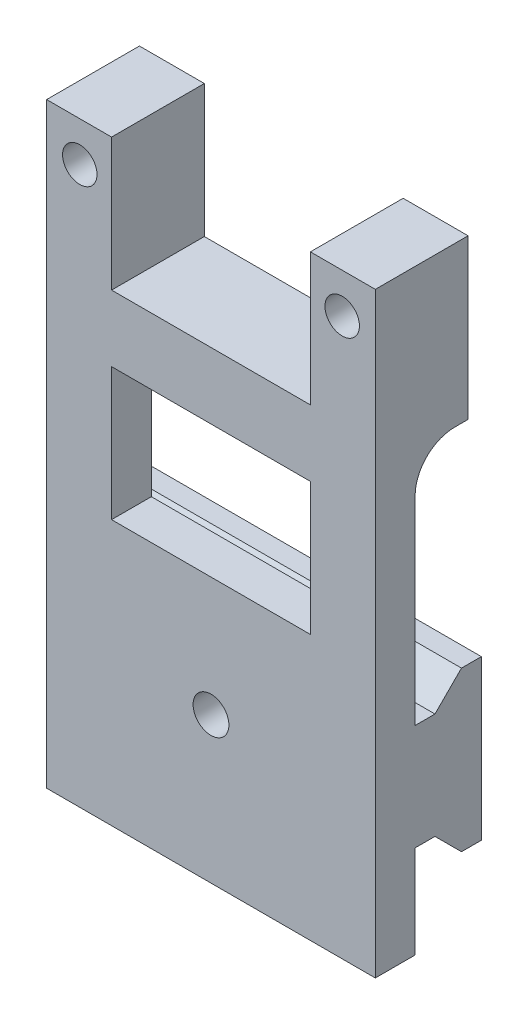
ISO-10303-21;
HEADER;
FILE_DESCRIPTION(('STEP AP214'),'2;1');
FILE_NAME('part.step','',(''),(''),'','','');
FILE_SCHEMA(('AUTOMOTIVE_DESIGN { 1 0 10303 214 1 1 1 1 }'));
ENDSEC;
DATA;
#1=APPLICATION_CONTEXT('core data for automotive mechanical design processes');
#2=APPLICATION_PROTOCOL_DEFINITION('international standard','automotive_design',2000,#1);
#3=PRODUCT_CONTEXT('',#1,'mechanical');
#4=PRODUCT('Part','Part','',(#3));
#5=PRODUCT_RELATED_PRODUCT_CATEGORY('part','',(#4));
#6=PRODUCT_DEFINITION_FORMATION('','',#4);
#7=PRODUCT_DEFINITION_CONTEXT('part definition',#1,'design');
#8=PRODUCT_DEFINITION('design','',#6,#7);
#9=PRODUCT_DEFINITION_SHAPE('','',#8);
#10=(LENGTH_UNIT() NAMED_UNIT(*) SI_UNIT(.MILLI.,.METRE.));
#11=(NAMED_UNIT(*) PLANE_ANGLE_UNIT() SI_UNIT($,.RADIAN.));
#12=(NAMED_UNIT(*) SI_UNIT($,.STERADIAN.) SOLID_ANGLE_UNIT());
#13=UNCERTAINTY_MEASURE_WITH_UNIT(LENGTH_MEASURE(1.E-05),#10,'distance_accuracy_value','');
#14=(GEOMETRIC_REPRESENTATION_CONTEXT(3) GLOBAL_UNCERTAINTY_ASSIGNED_CONTEXT((#13)) GLOBAL_UNIT_ASSIGNED_CONTEXT((#10,
#11,#12)) REPRESENTATION_CONTEXT('',''));
#15=CARTESIAN_POINT('',(0.,0.,0.));
#16=DIRECTION('',(0.,0.,1.));
#17=DIRECTION('',(1.,0.,0.));
#18=AXIS2_PLACEMENT_3D('',#15,#16,#17);
#19=CARTESIAN_POINT('',(12.4,-35.,4.));
#20=DIRECTION('',(0.,0.,1.));
#21=DIRECTION('',(1.,0.,0.));
#22=AXIS2_PLACEMENT_3D('',#19,#20,#21);
#23=PLANE('',#22);
#24=DIRECTION('',(1.,0.,0.));
#25=VECTOR('',#24,1.);
#26=CARTESIAN_POINT('',(-12.4,-28.,4.));
#27=LINE('',#26,#25);
#28=CARTESIAN_POINT('',(-12.4,-28.,4.));
#29=VERTEX_POINT('',#28);
#30=CARTESIAN_POINT('',(12.4,-28.,4.));
#31=VERTEX_POINT('',#30);
#32=EDGE_CURVE('E259',#29,#31,#27,.T.);
#33=ORIENTED_EDGE('',*,*,#32,.T.);
#34=DIRECTION('',(0.,1.,0.));
#35=VECTOR('',#34,1.);
#36=CARTESIAN_POINT('',(12.4,-35.,4.));
#37=LINE('',#36,#35);
#38=CARTESIAN_POINT('',(12.4,-35.,4.));
#39=VERTEX_POINT('',#38);
#40=EDGE_CURVE('E278',#39,#31,#37,.T.);
#41=ORIENTED_EDGE('',*,*,#40,.F.);
#42=DIRECTION('',(-1.,0.,0.));
#43=VECTOR('',#42,1.);
#44=CARTESIAN_POINT('',(12.4,-35.,4.));
#45=LINE('',#44,#43);
#46=CARTESIAN_POINT('',(-12.4,-35.,4.));
#47=VERTEX_POINT('',#46);
#48=EDGE_CURVE('E284',#39,#47,#45,.T.);
#49=ORIENTED_EDGE('',*,*,#48,.T.);
#50=DIRECTION('',(0.,1.,0.));
#51=VECTOR('',#50,1.);
#52=CARTESIAN_POINT('',(-12.4,-35.,4.));
#53=LINE('',#52,#51);
#54=EDGE_CURVE('E285',#47,#29,#53,.T.);
#55=ORIENTED_EDGE('',*,*,#54,.T.);
#56=EDGE_LOOP('',(#33,#41,#49,#55));
#57=FACE_BOUND('',#56,.T.);
#58=ADVANCED_FACE('F33',(#57),#23,.F.);
#59=DIRECTION('',(-1.,0.,0.));
#60=VECTOR('',#59,1.);
#61=CARTESIAN_POINT('',(12.4,-5.,4.));
#62=LINE('',#61,#60);
#63=CARTESIAN_POINT('',(-12.4,-5.,4.));
#64=VERTEX_POINT('',#63);
#65=CARTESIAN_POINT('',(-7.5,-5.,4.));
#66=VERTEX_POINT('',#65);
#67=EDGE_CURVE('E367',#64,#66,#62,.F.);
#68=ORIENTED_EDGE('',*,*,#67,.T.);
#69=DIRECTION('',(0.,-1.,0.));
#70=VECTOR('',#69,1.);
#71=CARTESIAN_POINT('',(-7.5,-35.,4.));
#72=LINE('',#71,#70);
#73=CARTESIAN_POINT('',(-7.5,-15.,4.));
#74=VERTEX_POINT('',#73);
#75=EDGE_CURVE('E218',#66,#74,#72,.T.);
#76=ORIENTED_EDGE('',*,*,#75,.T.);
#77=DIRECTION('',(1.,0.,0.));
#78=VECTOR('',#77,1.);
#79=CARTESIAN_POINT('',(12.4,-15.,4.));
#80=LINE('',#79,#78);
#81=CARTESIAN_POINT('',(7.5,-15.,4.));
#82=VERTEX_POINT('',#81);
#83=EDGE_CURVE('E221',#74,#82,#80,.T.);
#84=ORIENTED_EDGE('',*,*,#83,.T.);
#85=DIRECTION('',(0.,1.,0.));
#86=VECTOR('',#85,1.);
#87=CARTESIAN_POINT('',(7.5,-35.,4.));
#88=LINE('',#87,#86);
#89=CARTESIAN_POINT('',(7.5,-5.,4.));
#90=VERTEX_POINT('',#89);
#91=EDGE_CURVE('E196',#82,#90,#88,.T.);
#92=ORIENTED_EDGE('',*,*,#91,.T.);
#93=CARTESIAN_POINT('',(12.4,-5.,4.));
#94=VERTEX_POINT('',#93);
#95=EDGE_CURVE('E366',#90,#94,#62,.F.);
#96=ORIENTED_EDGE('',*,*,#95,.T.);
#97=CARTESIAN_POINT('',(12.4,-20.,4.));
#98=VERTEX_POINT('',#97);
#99=EDGE_CURVE('E282',#98,#94,#37,.T.);
#100=ORIENTED_EDGE('',*,*,#99,.F.);
#101=DIRECTION('',(1.,0.,0.));
#102=VECTOR('',#101,1.);
#103=CARTESIAN_POINT('',(-12.4,-20.,4.));
#104=LINE('',#103,#102);
#105=CARTESIAN_POINT('',(-12.4,-20.,4.));
#106=VERTEX_POINT('',#105);
#107=EDGE_CURVE('E256',#106,#98,#104,.T.);
#108=ORIENTED_EDGE('',*,*,#107,.F.);
#109=EDGE_CURVE('E277',#106,#64,#53,.T.);
#110=ORIENTED_EDGE('',*,*,#109,.T.);
#111=EDGE_LOOP('',(#68,#76,#84,#92,#96,#100,#108,#110));
#112=FACE_BOUND('',#111,.T.);
#113=ADVANCED_FACE('F380',(#112),#23,.F.);
#114=CARTESIAN_POINT('',(0.,0.,7.));
#115=DIRECTION('',(0.,0.,-1.));
#116=DIRECTION('',(-1.,0.,0.));
#117=AXIS2_PLACEMENT_3D('',#114,#115,#116);
#118=PLANE('',#117);
#119=CARTESIAN_POINT('',(0.,-24.,7.));
#120=DIRECTION('',(0.,0.,1.));
#121=DIRECTION('',(1.,0.,0.));
#122=AXIS2_PLACEMENT_3D('',#119,#120,#121);
#123=CIRCLE('',#122,1.35);
#124=CARTESIAN_POINT('',(1.35,-24.,7.));
#125=VERTEX_POINT('',#124);
#126=EDGE_CURVE('E650',#125,#125,#123,.T.);
#127=ORIENTED_EDGE('',*,*,#126,.F.);
#128=EDGE_LOOP('',(#127));
#129=FACE_BOUND('',#128,.T.);
#130=DIRECTION('',(1.,0.,0.));
#131=VECTOR('',#130,1.);
#132=CARTESIAN_POINT('',(-7.5,-15.,7.));
#133=LINE('',#132,#131);
#134=CARTESIAN_POINT('',(-7.5,-15.,7.));
#135=VERTEX_POINT('',#134);
#136=CARTESIAN_POINT('',(7.5,-15.,7.));
#137=VERTEX_POINT('',#136);
#138=EDGE_CURVE('E203',#135,#137,#133,.T.);
#139=ORIENTED_EDGE('',*,*,#138,.F.);
#140=DIRECTION('',(0.,-1.,0.));
#141=VECTOR('',#140,1.);
#142=CARTESIAN_POINT('',(-7.5,-5.,7.));
#143=LINE('',#142,#141);
#144=CARTESIAN_POINT('',(-7.5,-5.,7.));
#145=VERTEX_POINT('',#144);
#146=EDGE_CURVE('E48',#145,#135,#143,.T.);
#147=ORIENTED_EDGE('',*,*,#146,.F.);
#148=DIRECTION('',(-1.,0.,0.));
#149=VECTOR('',#148,1.);
#150=CARTESIAN_POINT('',(-7.5,-5.,7.));
#151=LINE('',#150,#149);
#152=CARTESIAN_POINT('',(7.5,-5.,7.));
#153=VERTEX_POINT('',#152);
#154=EDGE_CURVE('E209',#153,#145,#151,.T.);
#155=ORIENTED_EDGE('',*,*,#154,.F.);
#156=DIRECTION('',(0.,1.,0.));
#157=VECTOR('',#156,1.);
#158=CARTESIAN_POINT('',(7.5,-5.,7.));
#159=LINE('',#158,#157);
#160=EDGE_CURVE('E193',#137,#153,#159,.T.);
#161=ORIENTED_EDGE('',*,*,#160,.F.);
#162=EDGE_LOOP('',(#139,#147,#155,#161));
#163=FACE_BOUND('',#162,.T.);
#164=DIRECTION('',(-1.,0.,0.));
#165=VECTOR('',#164,1.);
#166=CARTESIAN_POINT('',(-12.4,10.,7.));
#167=LINE('',#166,#165);
#168=CARTESIAN_POINT('',(-7.5,10.,7.));
#169=VERTEX_POINT('',#168);
#170=CARTESIAN_POINT('',(-12.4,10.,7.));
#171=VERTEX_POINT('',#170);
#172=EDGE_CURVE('E307',#169,#171,#167,.T.);
#173=ORIENTED_EDGE('',*,*,#172,.T.);
#174=DIRECTION('',(0.,-1.,0.));
#175=VECTOR('',#174,1.);
#176=CARTESIAN_POINT('',(-12.4,-35.,7.));
#177=LINE('',#176,#175);
#178=CARTESIAN_POINT('',(-12.4,-35.,7.));
#179=VERTEX_POINT('',#178);
#180=EDGE_CURVE('E310',#171,#179,#177,.T.);
#181=ORIENTED_EDGE('',*,*,#180,.T.);
#182=DIRECTION('',(1.,0.,0.));
#183=VECTOR('',#182,1.);
#184=CARTESIAN_POINT('',(12.4,-35.,7.));
#185=LINE('',#184,#183);
#186=CARTESIAN_POINT('',(12.4,-35.,7.));
#187=VERTEX_POINT('',#186);
#188=EDGE_CURVE('E313',#179,#187,#185,.T.);
#189=ORIENTED_EDGE('',*,*,#188,.T.);
#190=DIRECTION('',(0.,1.,0.));
#191=VECTOR('',#190,1.);
#192=CARTESIAN_POINT('',(12.4,10.,7.));
#193=LINE('',#192,#191);
#194=CARTESIAN_POINT('',(12.4,10.,7.));
#195=VERTEX_POINT('',#194);
#196=EDGE_CURVE('E315',#187,#195,#193,.T.);
#197=ORIENTED_EDGE('',*,*,#196,.T.);
#198=DIRECTION('',(-1.,0.,0.));
#199=VECTOR('',#198,1.);
#200=CARTESIAN_POINT('',(7.5,10.,7.));
#201=LINE('',#200,#199);
#202=CARTESIAN_POINT('',(7.5,10.,7.));
#203=VERTEX_POINT('',#202);
#204=EDGE_CURVE('E317',#195,#203,#201,.T.);
#205=ORIENTED_EDGE('',*,*,#204,.T.);
#206=DIRECTION('',(0.,-1.,0.));
#207=VECTOR('',#206,1.);
#208=CARTESIAN_POINT('',(7.5,0.,7.));
#209=LINE('',#208,#207);
#210=CARTESIAN_POINT('',(7.5,0.,7.));
#211=VERTEX_POINT('',#210);
#212=EDGE_CURVE('E319',#203,#211,#209,.T.);
#213=ORIENTED_EDGE('',*,*,#212,.T.);
#214=DIRECTION('',(-1.,0.,0.));
#215=VECTOR('',#214,1.);
#216=CARTESIAN_POINT('',(-7.5,0.,7.));
#217=LINE('',#216,#215);
#218=CARTESIAN_POINT('',(-7.5,0.,7.));
#219=VERTEX_POINT('',#218);
#220=EDGE_CURVE('E321',#211,#219,#217,.T.);
#221=ORIENTED_EDGE('',*,*,#220,.T.);
#222=DIRECTION('',(0.,1.,0.));
#223=VECTOR('',#222,1.);
#224=CARTESIAN_POINT('',(-7.5,10.,7.));
#225=LINE('',#224,#223);
#226=EDGE_CURVE('E323',#219,#169,#225,.T.);
#227=ORIENTED_EDGE('',*,*,#226,.T.);
#228=EDGE_LOOP('',(#173,#181,#189,#197,#205,#213,#221,#227));
#229=FACE_BOUND('',#228,.T.);
#230=CARTESIAN_POINT('',(-9.9,7.,7.));
#231=DIRECTION('',(0.,0.,1.));
#232=DIRECTION('',(1.,0.,0.));
#233=AXIS2_PLACEMENT_3D('',#230,#231,#232);
#234=CIRCLE('',#233,1.3);
#235=CARTESIAN_POINT('',(-8.6,7.,7.));
#236=VERTEX_POINT('',#235);
#237=EDGE_CURVE('E301',#236,#236,#234,.T.);
#238=ORIENTED_EDGE('',*,*,#237,.F.);
#239=EDGE_LOOP('',(#238));
#240=FACE_BOUND('',#239,.T.);
#241=CARTESIAN_POINT('',(9.9,7.,7.));
#242=DIRECTION('',(0.,0.,1.));
#243=DIRECTION('',(1.,0.,0.));
#244=AXIS2_PLACEMENT_3D('',#241,#242,#243);
#245=CIRCLE('',#244,1.3);
#246=CARTESIAN_POINT('',(11.2,7.,7.));
#247=VERTEX_POINT('',#246);
#248=EDGE_CURVE('E295',#247,#247,#245,.T.);
#249=ORIENTED_EDGE('',*,*,#248,.F.);
#250=EDGE_LOOP('',(#249));
#251=FACE_BOUND('',#250,.T.);
#252=ADVANCED_FACE('F207',(#129,#163,#229,#240,#251),#118,.F.);
#253=CARTESIAN_POINT('',(0.,0.,0.));
#254=DIRECTION('',(0.,0.,-1.));
#255=DIRECTION('',(-1.,0.,0.));
#256=AXIS2_PLACEMENT_3D('',#253,#254,#255);
#257=PLANE('',#256);
#258=DIRECTION('',(-1.,0.,0.));
#259=VECTOR('',#258,1.);
#260=CARTESIAN_POINT('',(12.4,-2.,0.));
#261=LINE('',#260,#259);
#262=CARTESIAN_POINT('',(12.4,-2.,0.));
#263=VERTEX_POINT('',#262);
#264=CARTESIAN_POINT('',(-12.4,-2.,0.));
#265=VERTEX_POINT('',#264);
#266=EDGE_CURVE('E290',#263,#265,#261,.T.);
#267=ORIENTED_EDGE('',*,*,#266,.T.);
#268=DIRECTION('',(0.,-1.,0.));
#269=VECTOR('',#268,1.);
#270=CARTESIAN_POINT('',(-12.4,-35.,0.));
#271=LINE('',#270,#269);
#272=CARTESIAN_POINT('',(-12.4,10.,0.));
#273=VERTEX_POINT('',#272);
#274=EDGE_CURVE('E328',#273,#265,#271,.T.);
#275=ORIENTED_EDGE('',*,*,#274,.F.);
#276=DIRECTION('',(-1.,0.,0.));
#277=VECTOR('',#276,1.);
#278=CARTESIAN_POINT('',(-12.4,10.,0.));
#279=LINE('',#278,#277);
#280=CARTESIAN_POINT('',(-7.5,10.,0.));
#281=VERTEX_POINT('',#280);
#282=EDGE_CURVE('E304',#281,#273,#279,.T.);
#283=ORIENTED_EDGE('',*,*,#282,.F.);
#284=DIRECTION('',(0.,1.,0.));
#285=VECTOR('',#284,1.);
#286=CARTESIAN_POINT('',(-7.5,10.,0.));
#287=LINE('',#286,#285);
#288=CARTESIAN_POINT('',(-7.5,0.,0.));
#289=VERTEX_POINT('',#288);
#290=EDGE_CURVE('E311',#289,#281,#287,.T.);
#291=ORIENTED_EDGE('',*,*,#290,.F.);
#292=DIRECTION('',(-1.,0.,0.));
#293=VECTOR('',#292,1.);
#294=CARTESIAN_POINT('',(-7.5,0.,0.));
#295=LINE('',#294,#293);
#296=CARTESIAN_POINT('',(7.5,0.,0.));
#297=VERTEX_POINT('',#296);
#298=EDGE_CURVE('E337',#297,#289,#295,.T.);
#299=ORIENTED_EDGE('',*,*,#298,.F.);
#300=DIRECTION('',(0.,-1.,0.));
#301=VECTOR('',#300,1.);
#302=CARTESIAN_POINT('',(7.5,0.,0.));
#303=LINE('',#302,#301);
#304=CARTESIAN_POINT('',(7.5,10.,0.));
#305=VERTEX_POINT('',#304);
#306=EDGE_CURVE('E335',#305,#297,#303,.T.);
#307=ORIENTED_EDGE('',*,*,#306,.F.);
#308=DIRECTION('',(-1.,0.,0.));
#309=VECTOR('',#308,1.);
#310=CARTESIAN_POINT('',(7.5,10.,0.));
#311=LINE('',#310,#309);
#312=CARTESIAN_POINT('',(12.4,10.,0.));
#313=VERTEX_POINT('',#312);
#314=EDGE_CURVE('E333',#313,#305,#311,.T.);
#315=ORIENTED_EDGE('',*,*,#314,.F.);
#316=DIRECTION('',(0.,1.,0.));
#317=VECTOR('',#316,1.);
#318=CARTESIAN_POINT('',(12.4,10.,0.));
#319=LINE('',#318,#317);
#320=EDGE_CURVE('E331',#263,#313,#319,.T.);
#321=ORIENTED_EDGE('',*,*,#320,.F.);
#322=EDGE_LOOP('',(#267,#275,#283,#291,#299,#307,#315,#321));
#323=FACE_BOUND('',#322,.T.);
#324=CARTESIAN_POINT('',(-9.9,7.,0.));
#325=DIRECTION('',(0.,0.,1.));
#326=DIRECTION('',(1.,0.,0.));
#327=AXIS2_PLACEMENT_3D('',#324,#325,#326);
#328=CIRCLE('',#327,1.3);
#329=CARTESIAN_POINT('',(-8.6,7.,0.));
#330=VERTEX_POINT('',#329);
#331=EDGE_CURVE('E298',#330,#330,#328,.T.);
#332=ORIENTED_EDGE('',*,*,#331,.T.);
#333=EDGE_LOOP('',(#332));
#334=FACE_BOUND('',#333,.T.);
#335=CARTESIAN_POINT('',(9.9,7.,0.));
#336=DIRECTION('',(0.,0.,1.));
#337=DIRECTION('',(1.,0.,0.));
#338=AXIS2_PLACEMENT_3D('',#335,#336,#337);
#339=CIRCLE('',#338,1.3);
#340=CARTESIAN_POINT('',(11.2,7.,0.));
#341=VERTEX_POINT('',#340);
#342=EDGE_CURVE('E293',#341,#341,#339,.T.);
#343=ORIENTED_EDGE('',*,*,#342,.T.);
#344=EDGE_LOOP('',(#343));
#345=FACE_BOUND('',#344,.T.);
#346=ADVANCED_FACE('F403',(#323,#334,#345),#257,.T.);
#347=CARTESIAN_POINT('',(-12.4,10.,7.));
#348=DIRECTION('',(0.,-1.,0.));
#349=DIRECTION('',(1.,0.,0.));
#350=AXIS2_PLACEMENT_3D('',#347,#348,#349);
#351=PLANE('',#350);
#352=ORIENTED_EDGE('',*,*,#282,.T.);
#353=DIRECTION('',(0.,0.,-1.));
#354=VECTOR('',#353,1.);
#355=CARTESIAN_POINT('',(-12.4,10.,7.));
#356=LINE('',#355,#354);
#357=EDGE_CURVE('E360',#171,#273,#356,.T.);
#358=ORIENTED_EDGE('',*,*,#357,.F.);
#359=ORIENTED_EDGE('',*,*,#172,.F.);
#360=DIRECTION('',(0.,0.,-1.));
#361=VECTOR('',#360,1.);
#362=CARTESIAN_POINT('',(-7.5,10.,7.));
#363=LINE('',#362,#361);
#364=EDGE_CURVE('E325',#169,#281,#363,.T.);
#365=ORIENTED_EDGE('',*,*,#364,.T.);
#366=EDGE_LOOP('',(#352,#358,#359,#365));
#367=FACE_BOUND('',#366,.T.);
#368=ADVANCED_FACE('F486',(#367),#351,.F.);
#369=CARTESIAN_POINT('',(-12.4,-35.,7.));
#370=DIRECTION('',(1.,0.,0.));
#371=DIRECTION('',(0.,1.,0.));
#372=AXIS2_PLACEMENT_3D('',#369,#370,#371);
#373=PLANE('',#372);
#374=ORIENTED_EDGE('',*,*,#274,.T.);
#375=DIRECTION('',(0.,0.,-1.));
#376=VECTOR('',#375,1.);
#377=CARTESIAN_POINT('',(-12.4,-2.,0.));
#378=LINE('',#377,#376);
#379=CARTESIAN_POINT('',(-12.4,-2.,0.999999999999999));
#380=VERTEX_POINT('',#379);
#381=EDGE_CURVE('E288',#380,#265,#378,.T.);
#382=ORIENTED_EDGE('',*,*,#381,.F.);
#383=CARTESIAN_POINT('',(-12.4,-5.,1.));
#384=DIRECTION('',(1.,0.,0.));
#385=DIRECTION('',(0.,1.,0.));
#386=AXIS2_PLACEMENT_3D('',#383,#384,#385);
#387=CIRCLE('',#386,3.);
#388=EDGE_CURVE('E41',#380,#64,#387,.T.);
#389=ORIENTED_EDGE('',*,*,#388,.T.);
#390=ORIENTED_EDGE('',*,*,#109,.F.);
#391=DIRECTION('',(0.,0.,-1.));
#392=VECTOR('',#391,1.);
#393=CARTESIAN_POINT('',(-12.4,-20.,4.));
#394=LINE('',#393,#392);
#395=CARTESIAN_POINT('',(-12.4,-20.,2.5));
#396=VERTEX_POINT('',#395);
#397=EDGE_CURVE('E238',#106,#396,#394,.T.);
#398=ORIENTED_EDGE('',*,*,#397,.T.);
#399=DIRECTION('',(0.,0.707106781186554,-0.707106781186541));
#400=VECTOR('',#399,1.);
#401=CARTESIAN_POINT('',(-12.4,-20.,2.5));
#402=LINE('',#401,#400);
#403=CARTESIAN_POINT('',(-12.4,-17.9999999999999,0.500000000000014));
#404=VERTEX_POINT('',#403);
#405=EDGE_CURVE('E224',#396,#404,#402,.T.);
#406=ORIENTED_EDGE('',*,*,#405,.T.);
#407=DIRECTION('',(0.,0.,-1.));
#408=VECTOR('',#407,1.);
#409=CARTESIAN_POINT('',(-12.4,-17.9999999999999,0.500000000000014));
#410=LINE('',#409,#408);
#411=CARTESIAN_POINT('',(-12.4,-17.9999999999999,-0.999999999999986));
#412=VERTEX_POINT('',#411);
#413=EDGE_CURVE('E227',#404,#412,#410,.T.);
#414=ORIENTED_EDGE('',*,*,#413,.T.);
#415=DIRECTION('',(0.,-1.,0.));
#416=VECTOR('',#415,1.);
#417=CARTESIAN_POINT('',(-12.4,-17.9999999999999,-0.999999999999986));
#418=LINE('',#417,#416);
#419=CARTESIAN_POINT('',(-12.4,-30.,-0.999999999999985));
#420=VERTEX_POINT('',#419);
#421=EDGE_CURVE('E230',#412,#420,#418,.T.);
#422=ORIENTED_EDGE('',*,*,#421,.T.);
#423=DIRECTION('',(0.,0.,1.));
#424=VECTOR('',#423,1.);
#425=CARTESIAN_POINT('',(-12.4,-30.,-0.999999999999985));
#426=LINE('',#425,#424);
#427=CARTESIAN_POINT('',(-12.4,-30.,0.500000000000014));
#428=VERTEX_POINT('',#427);
#429=EDGE_CURVE('E232',#420,#428,#426,.T.);
#430=ORIENTED_EDGE('',*,*,#429,.T.);
#431=DIRECTION('',(0.,0.707106781186554,0.707106781186541));
#432=VECTOR('',#431,1.);
#433=CARTESIAN_POINT('',(-12.4,-30.,0.500000000000014));
#434=LINE('',#433,#432);
#435=CARTESIAN_POINT('',(-12.4,-28.,2.5));
#436=VERTEX_POINT('',#435);
#437=EDGE_CURVE('E234',#428,#436,#434,.T.);
#438=ORIENTED_EDGE('',*,*,#437,.T.);
#439=DIRECTION('',(0.,0.,1.));
#440=VECTOR('',#439,1.);
#441=CARTESIAN_POINT('',(-12.4,-28.,2.5));
#442=LINE('',#441,#440);
#443=EDGE_CURVE('E236',#436,#29,#442,.T.);
#444=ORIENTED_EDGE('',*,*,#443,.T.);
#445=ORIENTED_EDGE('',*,*,#54,.F.);
#446=DIRECTION('',(0.,0.,-1.));
#447=VECTOR('',#446,1.);
#448=CARTESIAN_POINT('',(-12.4,-35.,7.));
#449=LINE('',#448,#447);
#450=EDGE_CURVE('E357',#179,#47,#449,.T.);
#451=ORIENTED_EDGE('',*,*,#450,.F.);
#452=ORIENTED_EDGE('',*,*,#180,.F.);
#453=ORIENTED_EDGE('',*,*,#357,.T.);
#454=EDGE_LOOP('',(#374,#382,#389,#390,#398,#406,#414,#422,#430,#438,#444,#445,#451,#452,#453));
#455=FACE_BOUND('',#454,.T.);
#456=ADVANCED_FACE('F374',(#455),#373,.F.);
#457=CARTESIAN_POINT('',(12.4,-35.,7.));
#458=DIRECTION('',(0.,1.,0.));
#459=DIRECTION('',(0.,0.,1.));
#460=AXIS2_PLACEMENT_3D('',#457,#458,#459);
#461=PLANE('',#460);
#462=ORIENTED_EDGE('',*,*,#450,.T.);
#463=ORIENTED_EDGE('',*,*,#48,.F.);
#464=DIRECTION('',(0.,0.,-1.));
#465=VECTOR('',#464,1.);
#466=CARTESIAN_POINT('',(12.4,-35.,7.));
#467=LINE('',#466,#465);
#468=EDGE_CURVE('E354',#187,#39,#467,.T.);
#469=ORIENTED_EDGE('',*,*,#468,.F.);
#470=ORIENTED_EDGE('',*,*,#188,.F.);
#471=EDGE_LOOP('',(#462,#463,#469,#470));
#472=FACE_BOUND('',#471,.T.);
#473=ADVANCED_FACE('F423',(#472),#461,.F.);
#474=CARTESIAN_POINT('',(12.4,10.,7.));
#475=DIRECTION('',(-1.,0.,0.));
#476=DIRECTION('',(0.,-1.,0.));
#477=AXIS2_PLACEMENT_3D('',#474,#475,#476);
#478=PLANE('',#477);
#479=ORIENTED_EDGE('',*,*,#40,.T.);
#480=DIRECTION('',(0.,0.,1.));
#481=VECTOR('',#480,1.);
#482=CARTESIAN_POINT('',(12.4,-28.,2.5));
#483=LINE('',#482,#481);
#484=CARTESIAN_POINT('',(12.4,-28.,2.5));
#485=VERTEX_POINT('',#484);
#486=EDGE_CURVE('E251',#485,#31,#483,.T.);
#487=ORIENTED_EDGE('',*,*,#486,.F.);
#488=DIRECTION('',(0.,0.707106781186554,0.707106781186541));
#489=VECTOR('',#488,1.);
#490=CARTESIAN_POINT('',(12.4,-30.,0.500000000000014));
#491=LINE('',#490,#489);
#492=CARTESIAN_POINT('',(12.4,-30.,0.500000000000014));
#493=VERTEX_POINT('',#492);
#494=EDGE_CURVE('E249',#493,#485,#491,.T.);
#495=ORIENTED_EDGE('',*,*,#494,.F.);
#496=DIRECTION('',(0.,0.,1.));
#497=VECTOR('',#496,1.);
#498=CARTESIAN_POINT('',(12.4,-30.,-0.999999999999985));
#499=LINE('',#498,#497);
#500=CARTESIAN_POINT('',(12.4,-30.,-0.999999999999985));
#501=VERTEX_POINT('',#500);
#502=EDGE_CURVE('E247',#501,#493,#499,.T.);
#503=ORIENTED_EDGE('',*,*,#502,.F.);
#504=DIRECTION('',(0.,-1.,0.));
#505=VECTOR('',#504,1.);
#506=CARTESIAN_POINT('',(12.4,-17.9999999999999,-0.999999999999986));
#507=LINE('',#506,#505);
#508=CARTESIAN_POINT('',(12.4,-17.9999999999999,-0.999999999999986));
#509=VERTEX_POINT('',#508);
#510=EDGE_CURVE('E245',#509,#501,#507,.T.);
#511=ORIENTED_EDGE('',*,*,#510,.F.);
#512=DIRECTION('',(0.,0.,-1.));
#513=VECTOR('',#512,1.);
#514=CARTESIAN_POINT('',(12.4,-17.9999999999999,0.500000000000014));
#515=LINE('',#514,#513);
#516=CARTESIAN_POINT('',(12.4,-17.9999999999999,0.500000000000014));
#517=VERTEX_POINT('',#516);
#518=EDGE_CURVE('E243',#517,#509,#515,.T.);
#519=ORIENTED_EDGE('',*,*,#518,.F.);
#520=DIRECTION('',(0.,0.707106781186554,-0.707106781186541));
#521=VECTOR('',#520,1.);
#522=CARTESIAN_POINT('',(12.4,-20.,2.5));
#523=LINE('',#522,#521);
#524=CARTESIAN_POINT('',(12.4,-20.,2.5));
#525=VERTEX_POINT('',#524);
#526=EDGE_CURVE('E223',#525,#517,#523,.T.);
#527=ORIENTED_EDGE('',*,*,#526,.F.);
#528=DIRECTION('',(0.,0.,-1.));
#529=VECTOR('',#528,1.);
#530=CARTESIAN_POINT('',(12.4,-20.,4.));
#531=LINE('',#530,#529);
#532=EDGE_CURVE('E228',#98,#525,#531,.T.);
#533=ORIENTED_EDGE('',*,*,#532,.F.);
#534=ORIENTED_EDGE('',*,*,#99,.T.);
#535=CARTESIAN_POINT('',(12.4,-5.,1.));
#536=DIRECTION('',(-1.,0.,0.));
#537=DIRECTION('',(0.,-1.,0.));
#538=AXIS2_PLACEMENT_3D('',#535,#536,#537);
#539=CIRCLE('',#538,3.);
#540=CARTESIAN_POINT('',(12.4,-2.,0.999999999999999));
#541=VERTEX_POINT('',#540);
#542=EDGE_CURVE('E11',#94,#541,#539,.T.);
#543=ORIENTED_EDGE('',*,*,#542,.T.);
#544=DIRECTION('',(0.,0.,-1.));
#545=VECTOR('',#544,1.);
#546=CARTESIAN_POINT('',(12.4,-2.,0.));
#547=LINE('',#546,#545);
#548=EDGE_CURVE('E281',#541,#263,#547,.T.);
#549=ORIENTED_EDGE('',*,*,#548,.T.);
#550=ORIENTED_EDGE('',*,*,#320,.T.);
#551=DIRECTION('',(0.,0.,-1.));
#552=VECTOR('',#551,1.);
#553=CARTESIAN_POINT('',(12.4,10.,7.));
#554=LINE('',#553,#552);
#555=EDGE_CURVE('E351',#195,#313,#554,.T.);
#556=ORIENTED_EDGE('',*,*,#555,.F.);
#557=ORIENTED_EDGE('',*,*,#196,.F.);
#558=ORIENTED_EDGE('',*,*,#468,.T.);
#559=EDGE_LOOP('',(#479,#487,#495,#503,#511,#519,#527,#533,#534,#543,#549,#550,#556,#557,#558));
#560=FACE_BOUND('',#559,.T.);
#561=ADVANCED_FACE('F387',(#560),#478,.F.);
#562=CARTESIAN_POINT('',(7.5,10.,7.));
#563=DIRECTION('',(0.,-1.,0.));
#564=DIRECTION('',(1.,0.,0.));
#565=AXIS2_PLACEMENT_3D('',#562,#563,#564);
#566=PLANE('',#565);
#567=ORIENTED_EDGE('',*,*,#314,.T.);
#568=DIRECTION('',(0.,0.,-1.));
#569=VECTOR('',#568,1.);
#570=CARTESIAN_POINT('',(7.5,10.,7.));
#571=LINE('',#570,#569);
#572=EDGE_CURVE('E348',#203,#305,#571,.T.);
#573=ORIENTED_EDGE('',*,*,#572,.F.);
#574=ORIENTED_EDGE('',*,*,#204,.F.);
#575=ORIENTED_EDGE('',*,*,#555,.T.);
#576=EDGE_LOOP('',(#567,#573,#574,#575));
#577=FACE_BOUND('',#576,.T.);
#578=ADVANCED_FACE('F400',(#577),#566,.F.);
#579=CARTESIAN_POINT('',(7.5,0.,7.));
#580=DIRECTION('',(1.,0.,0.));
#581=DIRECTION('',(0.,0.,-1.));
#582=AXIS2_PLACEMENT_3D('',#579,#580,#581);
#583=PLANE('',#582);
#584=ORIENTED_EDGE('',*,*,#306,.T.);
#585=DIRECTION('',(0.,0.,-1.));
#586=VECTOR('',#585,1.);
#587=CARTESIAN_POINT('',(7.5,0.,7.));
#588=LINE('',#587,#586);
#589=EDGE_CURVE('E345',#211,#297,#588,.T.);
#590=ORIENTED_EDGE('',*,*,#589,.F.);
#591=ORIENTED_EDGE('',*,*,#212,.F.);
#592=ORIENTED_EDGE('',*,*,#572,.T.);
#593=EDGE_LOOP('',(#584,#590,#591,#592));
#594=FACE_BOUND('',#593,.T.);
#595=ADVANCED_FACE('F409',(#594),#583,.F.);
#596=CARTESIAN_POINT('',(-7.5,0.,7.));
#597=DIRECTION('',(0.,-1.,0.));
#598=DIRECTION('',(0.,0.,-1.));
#599=AXIS2_PLACEMENT_3D('',#596,#597,#598);
#600=PLANE('',#599);
#601=ORIENTED_EDGE('',*,*,#298,.T.);
#602=DIRECTION('',(0.,0.,-1.));
#603=VECTOR('',#602,1.);
#604=CARTESIAN_POINT('',(-7.5,0.,7.));
#605=LINE('',#604,#603);
#606=EDGE_CURVE('E342',#219,#289,#605,.T.);
#607=ORIENTED_EDGE('',*,*,#606,.F.);
#608=ORIENTED_EDGE('',*,*,#220,.F.);
#609=ORIENTED_EDGE('',*,*,#589,.T.);
#610=EDGE_LOOP('',(#601,#607,#608,#609));
#611=FACE_BOUND('',#610,.T.);
#612=ADVANCED_FACE('F413',(#611),#600,.F.);
#613=CARTESIAN_POINT('',(-7.5,10.,7.));
#614=DIRECTION('',(-1.,0.,0.));
#615=DIRECTION('',(0.,0.,1.));
#616=AXIS2_PLACEMENT_3D('',#613,#614,#615);
#617=PLANE('',#616);
#618=ORIENTED_EDGE('',*,*,#290,.T.);
#619=ORIENTED_EDGE('',*,*,#364,.F.);
#620=ORIENTED_EDGE('',*,*,#226,.F.);
#621=ORIENTED_EDGE('',*,*,#606,.T.);
#622=EDGE_LOOP('',(#618,#619,#620,#621));
#623=FACE_BOUND('',#622,.T.);
#624=ADVANCED_FACE('F479',(#623),#617,.F.);
#625=CARTESIAN_POINT('',(-9.9,7.,7.));
#626=DIRECTION('',(0.,0.,-1.));
#627=DIRECTION('',(-1.,0.,0.));
#628=AXIS2_PLACEMENT_3D('',#625,#626,#627);
#629=CYLINDRICAL_SURFACE('',#628,1.3);
#630=ORIENTED_EDGE('',*,*,#237,.T.);
#631=EDGE_LOOP('',(#630));
#632=FACE_BOUND('',#631,.T.);
#633=ORIENTED_EDGE('',*,*,#331,.F.);
#634=EDGE_LOOP('',(#633));
#635=FACE_BOUND('',#634,.T.);
#636=ADVANCED_FACE('F475',(#632,#635),#629,.F.);
#637=CARTESIAN_POINT('',(9.9,7.,7.));
#638=DIRECTION('',(0.,0.,-1.));
#639=DIRECTION('',(-1.,0.,0.));
#640=AXIS2_PLACEMENT_3D('',#637,#638,#639);
#641=CYLINDRICAL_SURFACE('',#640,1.3);
#642=ORIENTED_EDGE('',*,*,#248,.T.);
#643=EDGE_LOOP('',(#642));
#644=FACE_BOUND('',#643,.T.);
#645=ORIENTED_EDGE('',*,*,#342,.F.);
#646=EDGE_LOOP('',(#645));
#647=FACE_BOUND('',#646,.T.);
#648=ADVANCED_FACE('F472',(#644,#647),#641,.F.);
#649=CARTESIAN_POINT('',(12.4,-2.,0.));
#650=DIRECTION('',(0.,1.,0.));
#651=DIRECTION('',(0.,0.,1.));
#652=AXIS2_PLACEMENT_3D('',#649,#650,#651);
#653=PLANE('',#652);
#654=ORIENTED_EDGE('',*,*,#548,.F.);
#655=DIRECTION('',(-1.,0.,0.));
#656=VECTOR('',#655,1.);
#657=CARTESIAN_POINT('',(-12.4,-2.,0.999999999999999));
#658=LINE('',#657,#656);
#659=EDGE_CURVE('E363',#541,#380,#658,.T.);
#660=ORIENTED_EDGE('',*,*,#659,.T.);
#661=ORIENTED_EDGE('',*,*,#381,.T.);
#662=ORIENTED_EDGE('',*,*,#266,.F.);
#663=EDGE_LOOP('',(#654,#660,#661,#662));
#664=FACE_BOUND('',#663,.T.);
#665=ADVANCED_FACE('F391',(#664),#653,.F.);
#666=CARTESIAN_POINT('',(-12.4,-20.,2.5));
#667=DIRECTION('',(0.,-0.707106781186541,-0.707106781186554));
#668=DIRECTION('',(0.,0.707106781186554,-0.707106781186541));
#669=AXIS2_PLACEMENT_3D('',#666,#667,#668);
#670=PLANE('',#669);
#671=ORIENTED_EDGE('',*,*,#526,.T.);
#672=DIRECTION('',(1.,0.,0.));
#673=VECTOR('',#672,1.);
#674=CARTESIAN_POINT('',(-12.4,-17.9999999999999,0.500000000000014));
#675=LINE('',#674,#673);
#676=EDGE_CURVE('E274',#404,#517,#675,.T.);
#677=ORIENTED_EDGE('',*,*,#676,.F.);
#678=ORIENTED_EDGE('',*,*,#405,.F.);
#679=DIRECTION('',(1.,0.,0.));
#680=VECTOR('',#679,1.);
#681=CARTESIAN_POINT('',(-12.4,-20.,2.5));
#682=LINE('',#681,#680);
#683=EDGE_CURVE('E240',#396,#525,#682,.T.);
#684=ORIENTED_EDGE('',*,*,#683,.T.);
#685=EDGE_LOOP('',(#671,#677,#678,#684));
#686=FACE_BOUND('',#685,.T.);
#687=ADVANCED_FACE('F452',(#686),#670,.F.);
#688=CARTESIAN_POINT('',(-12.4,-17.9999999999999,0.500000000000014));
#689=DIRECTION('',(0.,-1.,0.));
#690=DIRECTION('',(0.,0.,-1.));
#691=AXIS2_PLACEMENT_3D('',#688,#689,#690);
#692=PLANE('',#691);
#693=ORIENTED_EDGE('',*,*,#518,.T.);
#694=DIRECTION('',(1.,0.,0.));
#695=VECTOR('',#694,1.);
#696=CARTESIAN_POINT('',(-12.4,-17.9999999999999,-0.999999999999986));
#697=LINE('',#696,#695);
#698=EDGE_CURVE('E271',#412,#509,#697,.T.);
#699=ORIENTED_EDGE('',*,*,#698,.F.);
#700=ORIENTED_EDGE('',*,*,#413,.F.);
#701=ORIENTED_EDGE('',*,*,#676,.T.);
#702=EDGE_LOOP('',(#693,#699,#700,#701));
#703=FACE_BOUND('',#702,.T.);
#704=ADVANCED_FACE('F449',(#703),#692,.F.);
#705=CARTESIAN_POINT('',(-12.4,-17.9999999999999,-0.999999999999986));
#706=DIRECTION('',(0.,0.,1.));
#707=DIRECTION('',(0.,-1.,0.));
#708=AXIS2_PLACEMENT_3D('',#705,#706,#707);
#709=PLANE('',#708);
#710=CARTESIAN_POINT('',(0.,-24.,-0.999999999999986));
#711=DIRECTION('',(0.,0.,1.));
#712=DIRECTION('',(1.,0.,0.));
#713=AXIS2_PLACEMENT_3D('',#710,#711,#712);
#714=CIRCLE('',#713,1.35);
#715=CARTESIAN_POINT('',(1.35,-24.,-0.999999999999986));
#716=VERTEX_POINT('',#715);
#717=EDGE_CURVE('E647',#716,#716,#714,.T.);
#718=ORIENTED_EDGE('',*,*,#717,.T.);
#719=EDGE_LOOP('',(#718));
#720=FACE_BOUND('',#719,.T.);
#721=ORIENTED_EDGE('',*,*,#510,.T.);
#722=DIRECTION('',(1.,0.,0.));
#723=VECTOR('',#722,1.);
#724=CARTESIAN_POINT('',(-12.4,-30.,-0.999999999999985));
#725=LINE('',#724,#723);
#726=EDGE_CURVE('E268',#420,#501,#725,.T.);
#727=ORIENTED_EDGE('',*,*,#726,.F.);
#728=ORIENTED_EDGE('',*,*,#421,.F.);
#729=ORIENTED_EDGE('',*,*,#698,.T.);
#730=EDGE_LOOP('',(#721,#727,#728,#729));
#731=FACE_BOUND('',#730,.T.);
#732=ADVANCED_FACE('F445',(#720,#731),#709,.F.);
#733=CARTESIAN_POINT('',(-12.4,-30.,-0.999999999999985));
#734=DIRECTION('',(0.,1.,0.));
#735=DIRECTION('',(0.,0.,1.));
#736=AXIS2_PLACEMENT_3D('',#733,#734,#735);
#737=PLANE('',#736);
#738=ORIENTED_EDGE('',*,*,#502,.T.);
#739=DIRECTION('',(1.,0.,0.));
#740=VECTOR('',#739,1.);
#741=CARTESIAN_POINT('',(-12.4,-30.,0.500000000000014));
#742=LINE('',#741,#740);
#743=EDGE_CURVE('E265',#428,#493,#742,.T.);
#744=ORIENTED_EDGE('',*,*,#743,.F.);
#745=ORIENTED_EDGE('',*,*,#429,.F.);
#746=ORIENTED_EDGE('',*,*,#726,.T.);
#747=EDGE_LOOP('',(#738,#744,#745,#746));
#748=FACE_BOUND('',#747,.T.);
#749=ADVANCED_FACE('F441',(#748),#737,.F.);
#750=CARTESIAN_POINT('',(-12.4,-30.,0.500000000000014));
#751=DIRECTION('',(0.,0.707106781186541,-0.707106781186554));
#752=DIRECTION('',(0.,0.707106781186554,0.707106781186541));
#753=AXIS2_PLACEMENT_3D('',#750,#751,#752);
#754=PLANE('',#753);
#755=ORIENTED_EDGE('',*,*,#494,.T.);
#756=DIRECTION('',(1.,0.,0.));
#757=VECTOR('',#756,1.);
#758=CARTESIAN_POINT('',(-12.4,-28.,2.5));
#759=LINE('',#758,#757);
#760=EDGE_CURVE('E262',#436,#485,#759,.T.);
#761=ORIENTED_EDGE('',*,*,#760,.F.);
#762=ORIENTED_EDGE('',*,*,#437,.F.);
#763=ORIENTED_EDGE('',*,*,#743,.T.);
#764=EDGE_LOOP('',(#755,#761,#762,#763));
#765=FACE_BOUND('',#764,.T.);
#766=ADVANCED_FACE('F437',(#765),#754,.F.);
#767=CARTESIAN_POINT('',(-12.4,-28.,2.5));
#768=DIRECTION('',(0.,1.,0.));
#769=DIRECTION('',(0.,0.,1.));
#770=AXIS2_PLACEMENT_3D('',#767,#768,#769);
#771=PLANE('',#770);
#772=ORIENTED_EDGE('',*,*,#486,.T.);
#773=ORIENTED_EDGE('',*,*,#32,.F.);
#774=ORIENTED_EDGE('',*,*,#443,.F.);
#775=ORIENTED_EDGE('',*,*,#760,.T.);
#776=EDGE_LOOP('',(#772,#773,#774,#775));
#777=FACE_BOUND('',#776,.T.);
#778=ADVANCED_FACE('F432',(#777),#771,.F.);
#779=CARTESIAN_POINT('',(-12.4,-20.,4.));
#780=DIRECTION('',(0.,-1.,0.));
#781=DIRECTION('',(0.,0.,-1.));
#782=AXIS2_PLACEMENT_3D('',#779,#780,#781);
#783=PLANE('',#782);
#784=ORIENTED_EDGE('',*,*,#532,.T.);
#785=ORIENTED_EDGE('',*,*,#683,.F.);
#786=ORIENTED_EDGE('',*,*,#397,.F.);
#787=ORIENTED_EDGE('',*,*,#107,.T.);
#788=EDGE_LOOP('',(#784,#785,#786,#787));
#789=FACE_BOUND('',#788,.T.);
#790=ADVANCED_FACE('F455',(#789),#783,.F.);
#791=CARTESIAN_POINT('',(12.4,-5.,1.));
#792=DIRECTION('',(1.,0.,0.));
#793=DIRECTION('',(0.,1.,0.));
#794=AXIS2_PLACEMENT_3D('',#791,#792,#793);
#795=CYLINDRICAL_SURFACE('',#794,3.);
#796=ORIENTED_EDGE('',*,*,#542,.F.);
#797=ORIENTED_EDGE('',*,*,#95,.F.);
#798=EDGE_CURVE('E369',#66,#90,#62,.F.);
#799=ORIENTED_EDGE('',*,*,#798,.F.);
#800=ORIENTED_EDGE('',*,*,#67,.F.);
#801=ORIENTED_EDGE('',*,*,#388,.F.);
#802=ORIENTED_EDGE('',*,*,#659,.F.);
#803=EDGE_LOOP('',(#796,#797,#799,#800,#801,#802));
#804=FACE_BOUND('',#803,.T.);
#805=ADVANCED_FACE('F35',(#804),#795,.F.);
#806=CARTESIAN_POINT('',(-7.5,-15.,-0.999999999999986));
#807=DIRECTION('',(0.,-1.,0.));
#808=DIRECTION('',(0.,0.,-1.));
#809=AXIS2_PLACEMENT_3D('',#806,#807,#808);
#810=PLANE('',#809);
#811=DIRECTION('',(0.,0.,1.));
#812=VECTOR('',#811,1.);
#813=CARTESIAN_POINT('',(-7.5,-15.,-0.999999999999986));
#814=LINE('',#813,#812);
#815=EDGE_CURVE('E200',#74,#135,#814,.T.);
#816=ORIENTED_EDGE('',*,*,#815,.T.);
#817=ORIENTED_EDGE('',*,*,#138,.T.);
#818=DIRECTION('',(0.,0.,1.));
#819=VECTOR('',#818,1.);
#820=CARTESIAN_POINT('',(7.5,-15.,-0.999999999999986));
#821=LINE('',#820,#819);
#822=EDGE_CURVE('E188',#82,#137,#821,.T.);
#823=ORIENTED_EDGE('',*,*,#822,.F.);
#824=ORIENTED_EDGE('',*,*,#83,.F.);
#825=EDGE_LOOP('',(#816,#817,#823,#824));
#826=FACE_BOUND('',#825,.T.);
#827=ADVANCED_FACE('F204',(#826),#810,.F.);
#828=CARTESIAN_POINT('',(-7.5,-5.,-0.999999999999986));
#829=DIRECTION('',(-1.,0.,0.));
#830=DIRECTION('',(0.,-1.,0.));
#831=AXIS2_PLACEMENT_3D('',#828,#829,#830);
#832=PLANE('',#831);
#833=DIRECTION('',(0.,0.,1.));
#834=VECTOR('',#833,1.);
#835=CARTESIAN_POINT('',(-7.5,-5.,-0.999999999999986));
#836=LINE('',#835,#834);
#837=EDGE_CURVE('E55',#66,#145,#836,.T.);
#838=ORIENTED_EDGE('',*,*,#837,.T.);
#839=ORIENTED_EDGE('',*,*,#146,.T.);
#840=ORIENTED_EDGE('',*,*,#815,.F.);
#841=ORIENTED_EDGE('',*,*,#75,.F.);
#842=EDGE_LOOP('',(#838,#839,#840,#841));
#843=FACE_BOUND('',#842,.T.);
#844=ADVANCED_FACE('F607',(#843),#832,.F.);
#845=CARTESIAN_POINT('',(-7.5,-5.,-0.999999999999986));
#846=DIRECTION('',(0.,1.,0.));
#847=DIRECTION('',(0.,0.,1.));
#848=AXIS2_PLACEMENT_3D('',#845,#846,#847);
#849=PLANE('',#848);
#850=DIRECTION('',(0.,0.,1.));
#851=VECTOR('',#850,1.);
#852=CARTESIAN_POINT('',(7.5,-5.,-0.999999999999986));
#853=LINE('',#852,#851);
#854=EDGE_CURVE('E199',#90,#153,#853,.T.);
#855=ORIENTED_EDGE('',*,*,#854,.T.);
#856=ORIENTED_EDGE('',*,*,#154,.T.);
#857=ORIENTED_EDGE('',*,*,#837,.F.);
#858=ORIENTED_EDGE('',*,*,#798,.T.);
#859=EDGE_LOOP('',(#855,#856,#857,#858));
#860=FACE_BOUND('',#859,.T.);
#861=ADVANCED_FACE('F615',(#860),#849,.F.);
#862=CARTESIAN_POINT('',(7.5,-5.,-0.999999999999986));
#863=DIRECTION('',(1.,0.,0.));
#864=DIRECTION('',(0.,1.,0.));
#865=AXIS2_PLACEMENT_3D('',#862,#863,#864);
#866=PLANE('',#865);
#867=ORIENTED_EDGE('',*,*,#822,.T.);
#868=ORIENTED_EDGE('',*,*,#160,.T.);
#869=ORIENTED_EDGE('',*,*,#854,.F.);
#870=ORIENTED_EDGE('',*,*,#91,.F.);
#871=EDGE_LOOP('',(#867,#868,#869,#870));
#872=FACE_BOUND('',#871,.T.);
#873=ADVANCED_FACE('F190',(#872),#866,.F.);
#874=CARTESIAN_POINT('',(0.,-24.,-0.999999999999986));
#875=DIRECTION('',(0.,0.,1.));
#876=DIRECTION('',(1.,0.,0.));
#877=AXIS2_PLACEMENT_3D('',#874,#875,#876);
#878=CYLINDRICAL_SURFACE('',#877,1.35);
#879=ORIENTED_EDGE('',*,*,#717,.F.);
#880=EDGE_LOOP('',(#879));
#881=FACE_BOUND('',#880,.T.);
#882=ORIENTED_EDGE('',*,*,#126,.T.);
#883=EDGE_LOOP('',(#882));
#884=FACE_BOUND('',#883,.T.);
#885=ADVANCED_FACE('F629',(#881,#884),#878,.F.);
#886=CLOSED_SHELL('',(#58,#113,#252,#346,#368,#456,#473,#561,#578,#595,#612,#624,#636,#648,#665,
#687,#704,#732,#749,#766,#778,#790,#805,#827,#844,#861,#873,#885));
#887=MANIFOLD_SOLID_BREP('B2',#886);
#888=ADVANCED_BREP_SHAPE_REPRESENTATION('',(#18,#887),#14);
#889=SHAPE_DEFINITION_REPRESENTATION(#9,#888);
ENDSEC;
END-ISO-10303-21;
